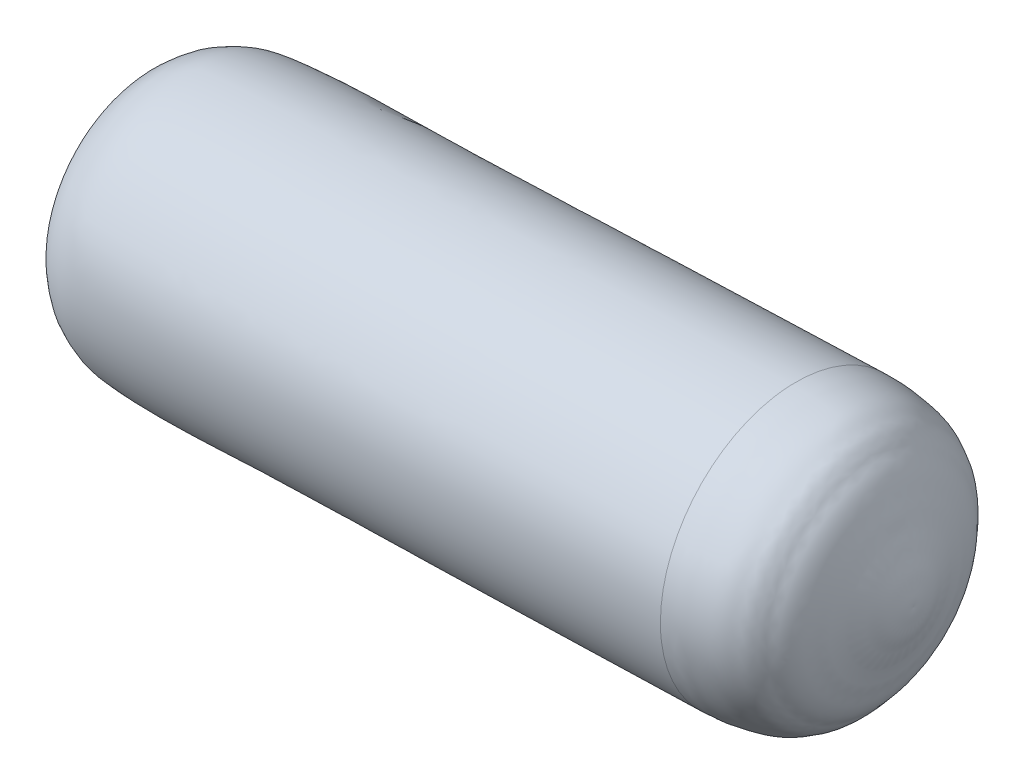
ISO-10303-21;
HEADER;
FILE_DESCRIPTION(('STEP AP214'),'2;1');
FILE_NAME('part.step','',(''),(''),'','','');
FILE_SCHEMA(('AUTOMOTIVE_DESIGN { 1 0 10303 214 1 1 1 1 }'));
ENDSEC;
DATA;
#1=APPLICATION_CONTEXT('core data for automotive mechanical design processes');
#2=APPLICATION_PROTOCOL_DEFINITION('international standard','automotive_design',2000,#1);
#3=PRODUCT_CONTEXT('',#1,'mechanical');
#4=PRODUCT('Part','Part','',(#3));
#5=PRODUCT_RELATED_PRODUCT_CATEGORY('part','',(#4));
#6=PRODUCT_DEFINITION_FORMATION('','',#4);
#7=PRODUCT_DEFINITION_CONTEXT('part definition',#1,'design');
#8=PRODUCT_DEFINITION('design','',#6,#7);
#9=PRODUCT_DEFINITION_SHAPE('','',#8);
#10=(LENGTH_UNIT() NAMED_UNIT(*) SI_UNIT(.MILLI.,.METRE.));
#11=(NAMED_UNIT(*) PLANE_ANGLE_UNIT() SI_UNIT($,.RADIAN.));
#12=(NAMED_UNIT(*) SI_UNIT($,.STERADIAN.) SOLID_ANGLE_UNIT());
#13=UNCERTAINTY_MEASURE_WITH_UNIT(LENGTH_MEASURE(1.E-05),#10,'distance_accuracy_value','');
#14=(GEOMETRIC_REPRESENTATION_CONTEXT(3) GLOBAL_UNCERTAINTY_ASSIGNED_CONTEXT((#13)) GLOBAL_UNIT_ASSIGNED_CONTEXT((#10,
#11,#12)) REPRESENTATION_CONTEXT('',''));
#15=CARTESIAN_POINT('',(0.,0.,0.));
#16=DIRECTION('',(0.,0.,1.));
#17=DIRECTION('',(1.,0.,0.));
#18=AXIS2_PLACEMENT_3D('',#15,#16,#17);
#19=CARTESIAN_POINT('',(-249.997315059477,86.4708925902134,9.03555901143604));
#20=CARTESIAN_POINT('',(-249.392839643392,86.775167829412,9.01524158176353));
#21=CARTESIAN_POINT('',(-244.904101907136,91.7279004312678,8.86436759938493));
#22=CARTESIAN_POINT('',(-242.245314390431,100.33289288089,8.77500130433415));
#23=CARTESIAN_POINT('',(-236.315603753676,111.038696427331,8.57569381285522));
#24=CARTESIAN_POINT('',(-232.331714899698,118.456197486051,8.44178864573028));
#25=CARTESIAN_POINT('',(-228.352755073559,125.567237763208,8.30804915147442));
#26=CARTESIAN_POINT('',(-224.64282545321,130.435672501077,8.18335221236713));
#27=CARTESIAN_POINT('',(-220.074052442527,134.236978606939,8.02978811056231));
#28=CARTESIAN_POINT('',(-215.978095541198,137.619159637047,7.89211614894086));
#29=CARTESIAN_POINT('',(-211.888479210006,139.506144457284,7.75465730448581));
#30=CARTESIAN_POINT('',(-207.937470942682,141.372100634887,7.62185730886851));
#31=CARTESIAN_POINT('',(-203.130942164617,143.183760423172,7.46030183809402));
#32=CARTESIAN_POINT('',(-196.968596145294,144.411431516793,7.25317508234248));
#33=CARTESIAN_POINT('',(-189.390501580477,145.200852321476,6.99846265024809));
#34=CARTESIAN_POINT('',(-178.71220949237,145.920748233469,6.63954739455784));
#35=CARTESIAN_POINT('',(-164.627353889003,146.457866721204,6.1661318419085));
#36=CARTESIAN_POINT('',(-142.443649789491,146.635629208932,5.42050044661258));
#37=CARTESIAN_POINT('',(-99.4522066639701,145.945993745118,3.97548614333521));
#38=CARTESIAN_POINT('',(-39.6649602200606,146.221481857096,1.96593680085844));
#39=CARTESIAN_POINT('',(29.454314195614,146.6489932236,-0.357277608836793));
#40=CARTESIAN_POINT('',(82.9011827569552,146.757531283674,-2.15371624689397));
#41=CARTESIAN_POINT('',(125.725845446338,146.873448404981,-3.59312478078548));
#42=CARTESIAN_POINT('',(148.092466784984,146.821762733771,-4.34490433040349));
#43=CARTESIAN_POINT('',(161.448063122901,147.001699590467,-4.79380825951195));
#44=CARTESIAN_POINT('',(162.912513872113,147.021429796287,-4.84303089837239));
#45=CARTESIAN_POINT('',(164.376964621325,147.041160002107,-4.89225353723284));
#46=B_SPLINE_CURVE_WITH_KNOTS('',3,(#19,#20,#21,#22,#23,#24,#25,#26,#27,#28,#29,#30,#31,#32,#33,
#34,#35,#36,#37,#38,#39,#40,#41,#42,#43,#44,#45),.UNSPECIFIED.,.F.,.F.,(4,1,1,1,1,1,1,1,1,1,1,1,
1,1,1,1,1,1,1,1,1,1,2,4),(0.00579873875436729,0.010719594045195,0.0495341063040441,
0.066049195348457,0.093708236145861,0.106676444318231,0.121341160904225,0.134878114114127,
0.146949418405602,0.157191348444054,0.165282813685045,0.176645251842296,0.191942847620492,
0.207773150546367,0.228359599879056,0.264583110954174,0.303440359648283,0.378941800817676,
0.556452706629631,0.709285089439045,0.848168664545565,0.919272177993649,1.,1.00994201261246),.UNSPECIFIED.);
#47=CARTESIAN_POINT('',(230.558173740901,64.9287620850524,-7.1167146586416));
#48=DIRECTION('',(-0.999435605909356,0.,0.0335927021925529));
#49=AXIS1_PLACEMENT('',#47,#48);
#50=SURFACE_OF_REVOLUTION('',#46,#49);
#51=OFFSET_SURFACE('',#50,-2.54,.F.);
#52=CARTESIAN_POINT('',(-251.028007892334,64.9287620850524,9.0702023213016));
#53=DIRECTION('',(-0.999435605909356,0.,0.0335927021925529));
#54=DIRECTION('',(0.0335927021925529,0.,0.999435605909356));
#55=AXIS2_PLACEMENT_3D('',#52,#53,#54);
#56=CIRCLE('',#55,23.8902883606627);
#57=CARTESIAN_POINT('',(-250.225468550141,64.9287620850524,32.9470071443898));
#58=VERTEX_POINT('',#57);
#59=EDGE_CURVE('E13',#58,#58,#56,.T.);
#60=ORIENTED_EDGE('',*,*,#59,.F.);
#61=EDGE_LOOP('',(#60));
#62=FACE_BOUND('',#61,.T.);
#63=CARTESIAN_POINT('',(162.807135501761,64.9287620850524,79.8014743777546));
#64=CARTESIAN_POINT('',(162.807136488084,66.3129163579225,79.8015037225309));
#65=CARTESIAN_POINT('',(162.805994318118,67.6970681324296,79.7675223734601));
#66=CARTESIAN_POINT('',(162.801430747682,70.4620384748768,79.6317489911236));
#67=CARTESIAN_POINT('',(162.798009347212,71.842857042817,79.5299569578594));
#68=CARTESIAN_POINT('',(162.78889439784,74.5978327624663,79.2587729106236));
#69=CARTESIAN_POINT('',(162.783200848938,75.9719899141748,79.0893808966463));
#70=CARTESIAN_POINT('',(162.769555629937,78.7103327908766,78.6834142184556));
#71=CARTESIAN_POINT('',(162.761603959838,80.0745185158708,78.4468395542481));
#72=CARTESIAN_POINT('',(162.743461571337,82.7896319744682,77.9070750260933));
#73=CARTESIAN_POINT('',(162.733270852935,84.140559708072,77.6038851621489));
#74=CARTESIAN_POINT('',(162.710674940525,86.8259027135277,76.9316213095482));
#75=CARTESIAN_POINT('',(162.698269746517,88.1603179853775,76.5625473208835));
#76=CARTESIAN_POINT('',(162.671274762109,90.8094213349857,75.7594041725231));
#77=CARTESIAN_POINT('',(162.65668497171,92.1241094127464,75.3253350128346));
#78=CARTESIAN_POINT('',(162.62535594419,94.7305911780609,74.393247280662));
#79=CARTESIAN_POINT('',(162.608616707068,96.0223848656126,73.8952287081719));
#80=CARTESIAN_POINT('',(162.573029111987,98.5799658054781,72.8364419080694));
#81=CARTESIAN_POINT('',(162.554180754029,99.8457530577947,72.2756736804636));
#82=CARTESIAN_POINT('',(162.514420324704,102.348271735275,71.0927385132247));
#83=CARTESIAN_POINT('',(162.493508253338,103.585003160435,70.4705715735849));
#84=CARTESIAN_POINT('',(162.449670776178,106.026430788958,69.1663378361334));
#85=CARTESIAN_POINT('',(162.426745370384,107.231126992324,68.484271038328));
#86=CARTESIAN_POINT('',(162.378936453697,109.605581958874,67.0618807433092));
#87=CARTESIAN_POINT('',(162.354052942804,110.775340722053,66.3215572460891));
#88=CARTESIAN_POINT('',(162.302387762544,113.077102756674,64.7844370564493));
#89=CARTESIAN_POINT('',(162.275606093176,114.209106028119,63.9876403640338));
#90=CARTESIAN_POINT('',(162.220209115215,116.432629984336,62.3394933369947));
#91=CARTESIAN_POINT('',(162.191593806621,117.524150669107,61.4881430023708));
#92=CARTESIAN_POINT('',(162.132598487105,119.664079883065,59.7329396684121));
#93=CARTESIAN_POINT('',(162.102218476184,120.712488412251,58.8290866690757));
#94=CARTESIAN_POINT('',(162.03976694007,122.763667607009,56.9710554667773));
#95=CARTESIAN_POINT('',(162.007695414878,123.766438272582,56.0168772638163));
#96=CARTESIAN_POINT('',(161.941938113336,125.723925977766,54.060494353125));
#97=CARTESIAN_POINT('',(161.908252336988,126.678643017377,53.0582896453949));
#98=CARTESIAN_POINT('',(161.839347685157,128.537723473749,51.0082681239967));
#99=CARTESIAN_POINT('',(161.804128809675,129.442086890506,49.9604513103247));
#100=CARTESIAN_POINT('',(161.732242804872,131.198281410286,47.8217298597419));
#101=CARTESIAN_POINT('',(161.695575675551,132.050112513316,46.7308252228366));
#102=CARTESIAN_POINT('',(161.620881497515,133.699190270066,44.5085562104323));
#103=CARTESIAN_POINT('',(161.582854448799,134.496436923784,43.3771918349316));
#104=CARTESIAN_POINT('',(161.505532042251,136.034425144866,41.0767289012366));
#105=CARTESIAN_POINT('',(161.466236684417,136.775166712228,39.9076303430414));
#106=CARTESIAN_POINT('',(161.386472325818,138.198360249203,37.5345155049063));
#107=CARTESIAN_POINT('',(161.346003325053,138.88081221882,36.3304992249695));
#108=CARTESIAN_POINT('',(161.2639891738,140.18578247391,33.8904495237354));
#109=CARTESIAN_POINT('',(161.222444023312,140.808300759373,32.6544161024328));
#110=CARTESIAN_POINT('',(161.138377658656,141.991903944907,30.1533098315303));
#111=CARTESIAN_POINT('',(161.095856444488,142.552988844982,28.8882369819326));
#112=CARTESIAN_POINT('',(161.009940389656,143.612373557068,26.3320995257906));
#113=CARTESIAN_POINT('',(160.966545548992,144.110673369085,25.0410349192492));
#114=CARTESIAN_POINT('',(160.87898678323,145.043287457279,22.4360242366774));
#115=CARTESIAN_POINT('',(160.834822858132,145.47760173345,21.1220781606449));
#116=CARTESIAN_POINT('',(160.745832318279,146.281198448797,18.474469950282));
#117=CARTESIAN_POINT('',(160.701005703525,146.650480887967,17.1408078159499));
#118=CARTESIAN_POINT('',(160.610797775578,147.323124295475,14.4569803981926));
#119=CARTESIAN_POINT('',(160.565416462384,147.626485263823,13.1068151147697));
#120=CARTESIAN_POINT('',(160.474208465023,148.166554906641,10.3932340649116));
#121=CARTESIAN_POINT('',(160.428381780854,148.403263581104,9.02981829847479));
#122=CARTESIAN_POINT('',(160.336393442202,148.809458384158,6.29302087086646));
#123=CARTESIAN_POINT('',(160.290231787718,148.978944512755,4.91963920969585));
#124=CARTESIAN_POINT('',(160.197684715774,149.250285917182,2.16621858918405));
#125=CARTESIAN_POINT('',(160.151299298314,149.35214119301,0.786179629842705));
#126=CARTESIAN_POINT('',(160.05841644707,149.487975513609,-1.97723095221103));
#127=CARTESIAN_POINT('',(160.011919013286,149.521954558383,-3.36060257492333));
#128=CARTESIAN_POINT('',(159.918924145647,149.521954558383,-6.1273458203472));
#129=CARTESIAN_POINT('',(159.872426711791,149.487975513609,-7.51071744305878));
#130=CARTESIAN_POINT('',(159.77954386053,149.35214119301,-10.2741280251106));
#131=CARTESIAN_POINT('',(159.733158443125,149.250285917182,-11.6541669844508));
#132=CARTESIAN_POINT('',(159.640611371206,148.978944512742,-14.4075876051037));
#133=CARTESIAN_POINT('',(159.594449716693,148.809458384123,-15.7809692664159));
#134=CARTESIAN_POINT('',(159.502461378046,148.403263581055,-18.5177666940246));
#135=CARTESIAN_POINT('',(159.456634693914,148.166554906612,-19.8811824603221));
#136=CARTESIAN_POINT('',(159.365426696651,147.626485263822,-22.5947635100437));
#137=CARTESIAN_POINT('',(159.32004538352,147.323124295476,-23.9449287934679));
#138=CARTESIAN_POINT('',(159.229837455495,146.650480887969,-26.6287562112201));
#139=CARTESIAN_POINT('',(159.1850108406,146.281198448798,-27.9624183455457));
#140=CARTESIAN_POINT('',(159.096020300708,145.477601733444,-30.6100265559323));
#141=CARTESIAN_POINT('',(159.05185637571,145.043287457265,-31.9239726319945));
#142=CARTESIAN_POINT('',(158.964297610033,144.110673369024,-34.5289833146933));
#143=CARTESIAN_POINT('',(158.920902769354,143.612373556964,-35.820047921331));
#144=CARTESIAN_POINT('',(158.834986714489,142.552988844826,-38.3761853775653));
#145=CARTESIAN_POINT('',(158.792465500303,141.991903944745,-39.6412582271612));
#146=CARTESIAN_POINT('',(158.708399135633,140.808300759301,-42.1423644978428));
#147=CARTESIAN_POINT('',(158.666853985148,140.185782473944,-43.3783979189314));
#148=CARTESIAN_POINT('',(158.584839833872,138.880812218875,-45.8184476201458));
#149=CARTESIAN_POINT('',(158.544370833081,138.198360249154,-47.0224639002666));
#150=CARTESIAN_POINT('',(158.464606474498,136.775166712115,-49.395578738488));
#151=CARTESIAN_POINT('',(158.425311116707,136.034425144806,-50.5646772965936));
#152=CARTESIAN_POINT('',(158.347988710165,134.496436923731,-52.8651402302792));
#153=CARTESIAN_POINT('',(158.309961661416,133.699190269958,-53.9965046058546));
#154=CARTESIAN_POINT('',(158.235267483367,132.050112513201,-56.2187736182546));
#155=CARTESIAN_POINT('',(158.198600354067,131.198281410225,-57.3096782550863));
#156=CARTESIAN_POINT('',(158.126714349253,129.442086890533,-59.4483997055606));
#157=CARTESIAN_POINT('',(158.09149547374,128.537723473808,-60.4962165191963));
#158=CARTESIAN_POINT('',(158.022590821918,126.678643017443,-62.5462380405949));
#159=CARTESIAN_POINT('',(157.988905045609,125.723925977803,-63.5484427483587));
#160=CARTESIAN_POINT('',(157.923147744099,123.766438272547,-65.5048256591234));
#161=CARTESIAN_POINT('',(157.891076218898,122.76366760693,-66.4590038621235));
#162=CARTESIAN_POINT('',(157.828624682764,120.712488412166,-68.3170350644188));
#163=CARTESIAN_POINT('',(157.798244671831,119.664079883022,-69.2208880637172));
#164=CARTESIAN_POINT('',(157.739249352352,117.52415066906,-70.9760913976806));
#165=CARTESIAN_POINT('',(157.710634043806,116.432629984241,-71.8274417323426));
#166=CARTESIAN_POINT('',(157.655237065845,114.209106028022,-73.4755887593741));
#167=CARTESIAN_POINT('',(157.628455396431,113.077102756627,-74.2723854517485));
#168=CARTESIAN_POINT('',(157.576790216148,110.775340722108,-75.8095056413282));
#169=CARTESIAN_POINT('',(157.551906705279,109.605581958982,-76.549829138529));
#170=CARTESIAN_POINT('',(157.504097788619,107.23112699243,-77.9722194335253));
#171=CARTESIAN_POINT('',(157.481172382826,106.026430789007,-78.6542862313223));
#172=CARTESIAN_POINT('',(157.437334905661,103.585003160434,-79.9585199689143));
#173=CARTESIAN_POINT('',(157.416422834287,102.348271735284,-80.5806869087059));
#174=CARTESIAN_POINT('',(157.376662404981,99.8457530576655,-81.7636220755833));
#175=CARTESIAN_POINT('',(157.357814047047,98.5799658051984,-82.3243903026697));
#176=CARTESIAN_POINT('',(157.322226451905,96.0223848654065,-83.3831771043187));
#177=CARTESIAN_POINT('',(157.305487214697,94.7305911780839,-83.8811956788868));
#178=CARTESIAN_POINT('',(157.27415818735,92.1241094125238,-84.8132834052242));
#179=CARTESIAN_POINT('',(157.259568397212,90.8094213342847,-85.2473525569888));
#180=CARTESIAN_POINT('',(157.232573412085,88.1603179857565,-86.0504957270577));
#181=CARTESIAN_POINT('',(157.220168217096,86.8259027154682,-86.4195697453639));
#182=CARTESIAN_POINT('',(157.197572307421,84.1405597060471,-87.0918335168986));
#183=CARTESIAN_POINT('',(157.187381592736,82.7896319669141,-87.3950232701262));
#184=CARTESIAN_POINT('',(157.169239194064,80.0745185230996,-87.934788100823));
#185=CARTESIAN_POINT('',(157.161287510077,78.7103328184183,-88.1713631782936));
#186=CARTESIAN_POINT('',(157.147642329025,75.9719898862942,-88.5773287274029));
#187=CARTESIAN_POINT('',(157.14194883196,74.5978326588512,-88.7467191990398));
#188=CARTESIAN_POINT('',(157.132833740972,71.8428571463244,-89.0179074599972));
#189=CARTESIAN_POINT('',(157.129412147049,70.4620388612405,-89.1197052493158));
#190=CARTESIAN_POINT('',(157.124849105179,67.6970677457883,-89.2554629058276));
#191=CARTESIAN_POINT('',(157.123707657232,66.3129149154204,-89.2894227730269));
#192=CARTESIAN_POINT('',(157.123707657231,63.5446092546131,-89.2894227730269));
#193=CARTESIAN_POINT('',(157.124849105178,62.1604564241737,-89.2554629058241));
#194=CARTESIAN_POINT('',(157.129412147051,59.3954853087289,-89.1197052493057));
#195=CARTESIAN_POINT('',(157.132833740977,58.0146670237234,-89.0179074599915));
#196=CARTESIAN_POINT('',(157.141948831959,55.2596915113039,-88.746719199045));
#197=CARTESIAN_POINT('',(157.147642329014,53.88553428389,-88.5773287274124));
#198=CARTESIAN_POINT('',(157.161287510087,51.1471913517521,-88.1713631783056));
#199=CARTESIAN_POINT('',(157.169239194106,49.7830056470284,-87.9347881008299));
#200=CARTESIAN_POINT('',(157.187381592774,47.0678922030757,-87.3950232701047));
#201=CARTESIAN_POINT('',(157.197572307423,45.7169644638475,-87.0918335168513));
#202=CARTESIAN_POINT('',(157.220168217097,43.0316214544327,-86.4195697453075));
#203=CARTESIAN_POINT('',(157.23257341212,41.6972061842433,-86.0504957270276));
#204=CARTESIAN_POINT('',(157.259568397265,39.0481028357777,-85.2473525569784));
#205=CARTESIAN_POINT('',(157.274158187387,37.7334147575042,-84.8132834052004));
#206=CARTESIAN_POINT('',(157.305487214689,35.1269329918766,-83.8811956788327));
#207=CARTESIAN_POINT('',(157.322226451868,33.835139304521,-83.3831771042475));
#208=CARTESIAN_POINT('',(157.357814047,31.2775583647384,-82.3243903025937));
#209=CARTESIAN_POINT('',(157.376662404951,30.0117711123122,-81.7636220755235));
#210=CARTESIAN_POINT('',(157.416422834286,27.5092524347744,-80.5806869086819));
#211=CARTESIAN_POINT('',(157.437334905668,26.272521009663,-79.95851996891));
#212=CARTESIAN_POINT('',(157.481172382818,23.8310933811348,-78.6542862313421));
#213=CARTESIAN_POINT('',(157.504097788585,22.626397177717,-77.9722194335479));
#214=CARTESIAN_POINT('',(157.551906705244,20.2519422111367,-76.5498291385364));
#215=CARTESIAN_POINT('',(157.576790216136,19.0821834479765,-75.8095056413155));
#216=CARTESIAN_POINT('',(157.628455396444,16.7804214134106,-74.2723854517033));
#217=CARTESIAN_POINT('',(157.655237065858,15.6484181420015,-73.475588759317));
#218=CARTESIAN_POINT('',(157.710634043813,13.4248941857815,-71.8274417322792));
#219=CARTESIAN_POINT('',(157.739249352353,12.3333735009733,-70.9760913976237));
#220=CARTESIAN_POINT('',(157.798244671836,10.1934442869734,-69.2208880636258));
#221=CARTESIAN_POINT('',(157.828624682779,9.14503575778173,-68.3170350642833));
#222=CARTESIAN_POINT('',(157.891076218917,7.09385656307995,-66.4590038620328));
#223=CARTESIAN_POINT('',(157.923147744112,6.091085897566,-65.504825659129));
#224=CARTESIAN_POINT('',(157.988905045626,4.13359819239508,-63.5484427484565));
#225=CARTESIAN_POINT('',(158.022590821947,3.17888115274277,-62.5462380406831));
#226=CARTESIAN_POINT('',(158.09149547376,1.31980069639895,-60.4962165193131));
#227=CARTESIAN_POINT('',(158.126714349254,0.415437279705917,-59.4483997057179));
#228=CARTESIAN_POINT('',(158.198600354059,-1.34075724007635,-57.3096782551463));
#229=CARTESIAN_POINT('',(158.235267483372,-2.192588343165,-56.2187736181694));
#230=CARTESIAN_POINT('',(158.309961661443,-3.8416660999544,-53.9965046057116));
#231=CARTESIAN_POINT('',(158.347988710203,-4.63891275365737,-52.8651402302323));
#232=CARTESIAN_POINT('',(158.425311116739,-6.17690097472454,-50.564677296562));
#233=CARTESIAN_POINT('',(158.464606474515,-6.91764254208657,-49.3955787383695));
#234=CARTESIAN_POINT('',(158.544370833094,-8.3408360791353,-47.0224639001159));
#235=CARTESIAN_POINT('',(158.584839833895,-9.0232880488208,-45.8184476200539));
#236=CARTESIAN_POINT('',(158.666853985132,-10.328258303896,-43.3783979188221));
#237=CARTESIAN_POINT('',(158.708399135566,-10.9507765892887,-42.1423644976538));
#238=CARTESIAN_POINT('',(158.792465500221,-12.1343797747145,-39.6412582269867));
#239=CARTESIAN_POINT('',(158.834986714442,-12.6954646747504,-38.3761853774893));
#240=CARTESIAN_POINT('',(158.920902769316,-13.7548493868725,-35.8200479212973));
#241=CARTESIAN_POINT('',(158.964297609969,-14.253149198953,-34.5289833146004));
#242=CARTESIAN_POINT('',(159.051856375695,-15.1857632872154,-31.9239726318304));
#243=CARTESIAN_POINT('',(159.096020300768,-15.6200775633969,-30.6100265557571));
#244=CARTESIAN_POINT('',(159.185010840613,-16.4236742787162,-27.9624183454592));
#245=CARTESIAN_POINT('',(159.229837455384,-16.7929567178556,-26.628756211235));
#246=CARTESIAN_POINT('',(159.320045383386,-17.4656001253507,-23.9449287935465));
#247=CARTESIAN_POINT('',(159.365426696616,-17.7689610937087,-22.5947635100827));
#248=CARTESIAN_POINT('',(159.456634693948,-18.3090307365149,-19.8811824602848));
#249=CARTESIAN_POINT('',(159.502461378048,-18.5457394109625,-18.5177666939506));
#250=CARTESIAN_POINT('',(159.594449716688,-18.9519342140168,-15.7809692664149));
#251=CARTESIAN_POINT('',(159.640611371226,-19.1214203426229,-14.4075876052133));
#252=CARTESIAN_POINT('',(159.733158443172,-19.3927617470637,-11.6541669846352));
#253=CARTESIAN_POINT('',(159.779543860579,-19.4946170228968,-10.2741280252585));
#254=CARTESIAN_POINT('',(159.872426711814,-19.6304513435032,-7.51071744313234));
#255=CARTESIAN_POINT('',(159.918924145642,-19.6644303882782,-6.12734582038297));
#256=CARTESIAN_POINT('',(160.011919013291,-19.6644303882783,-3.36060257488561));
#257=CARTESIAN_POINT('',(160.058416447111,-19.6304513435033,-1.97723095213763));
#258=CARTESIAN_POINT('',(160.151299298359,-19.4946170229002,0.786179629915895));
#259=CARTESIAN_POINT('',(160.197684715786,-19.3927617470738,2.16621858922152));
#260=CARTESIAN_POINT('',(160.290231787712,-19.1214203426465,4.91963920973385));
#261=CARTESIAN_POINT('',(160.33639344221,-18.9519342140437,6.29302087094037));
#262=CARTESIAN_POINT('',(160.428381780854,-18.5457394109861,9.02981829854742));
#263=CARTESIAN_POINT('',(160.474208465,-18.3090307365288,10.3932340649476));
#264=CARTESIAN_POINT('',(160.56541646234,-17.7689610936956,13.1068151148805));
#265=CARTESIAN_POINT('',(160.610797775534,-17.4656001253203,14.4569803984134));
#266=CARTESIAN_POINT('',(160.701005703514,-16.7929567178176,17.1408078161035));
#267=CARTESIAN_POINT('',(160.745832318301,-16.4236742786945,18.4744699502618));
#268=CARTESIAN_POINT('',(160.83482285819,-15.6200775634116,21.1220781604375));
#269=CARTESIAN_POINT('',(160.878986783293,-15.1857632872498,22.4360242364544));
#270=CARTESIAN_POINT('',(160.966545549008,-14.253149199015,25.0410349191639));
#271=CARTESIAN_POINT('',(161.009940389619,-13.75484938694,26.3320995258557));
#272=CARTESIAN_POINT('',(161.095856444459,-12.6954646748033,28.8882369821015));
#273=CARTESIAN_POINT('',(161.138377658687,-12.134379774744,30.1533098316565));
#274=CARTESIAN_POINT('',(161.222444023357,-10.9507765892649,32.6544161024363));
#275=CARTESIAN_POINT('',(161.263989173799,-10.3282583038421,33.8904495236598));
#276=CARTESIAN_POINT('',(161.34600332505,-9.02328804874034,36.3304992249278));
#277=CARTESIAN_POINT('',(161.386472325861,-8.34083607906178,37.5345155049726));
#278=CARTESIAN_POINT('',(161.466236684431,-6.91764254201017,39.9076303432237));
#279=CARTESIAN_POINT('',(161.50553204219,-6.17690097463683,41.0767289014299));
#280=CARTESIAN_POINT('',(161.582854448736,-4.63891275362001,43.3771918350137));
#281=CARTESIAN_POINT('',(161.620881497523,-3.84166609998414,44.5085562103964));
#282=CARTESIAN_POINT('',(161.695575675606,-2.19258834322057,46.7308252228282));
#283=CARTESIAN_POINT('',(161.732242804902,-1.34075724008285,47.8217298598699));
#284=CARTESIAN_POINT('',(161.804128809692,0.415437279737889,49.9604513104852));
#285=CARTESIAN_POINT('',(161.839347685186,1.31980069641639,51.0082681240625));
#286=CARTESIAN_POINT('',(161.90825233702,3.17888115273043,53.0582896453984));
#287=CARTESIAN_POINT('',(161.941938113359,4.13359819236753,54.0604943531556));
#288=CARTESIAN_POINT('',(162.007695414884,6.09108589757225,56.0168772638642));
#289=CARTESIAN_POINT('',(162.03976694007,7.09385656313844,56.9710554668169));
#290=CARTESIAN_POINT('',(162.102218476184,9.14503575785613,58.8290866690763));
#291=CARTESIAN_POINT('',(162.132598487112,10.1934442870074,59.7329396683833));
#292=CARTESIAN_POINT('',(162.191593806612,12.3333735009381,61.4881430023236));
#293=CARTESIAN_POINT('',(162.220209115185,13.4248941857182,62.3394933369563));
#294=CARTESIAN_POINT('',(162.275606093156,15.6484181419407,63.9876403640018));
#295=CARTESIAN_POINT('',(162.302387762555,16.7804214133824,64.7844370564156));
#296=CARTESIAN_POINT('',(162.354052942833,19.0821834479305,66.3215572460086));
#297=CARTESIAN_POINT('',(162.378936453712,20.2519422110375,67.0618807431869));
#298=CARTESIAN_POINT('',(162.426745370361,22.6263971776099,68.484271038232));
#299=CARTESIAN_POINT('',(162.449670776131,23.8310933810764,69.1663378360971));
#300=CARTESIAN_POINT('',(162.493508253295,26.2725210096636,70.4705715735815));
#301=CARTESIAN_POINT('',(162.514420324691,27.509252434784,71.0927385132014));
#302=CARTESIAN_POINT('',(162.554180754025,30.011771112303,72.2756736804621));
#303=CARTESIAN_POINT('',(162.573029111964,31.2775583647011,72.8364419081037));
#304=CARTESIAN_POINT('',(162.608616707035,33.8351393045735,73.8952287082032));
#305=CARTESIAN_POINT('',(162.625355944168,35.1269329920473,74.3932472806622));
#306=CARTESIAN_POINT('',(162.656684971719,37.7334147573892,75.3253350128468));
#307=CARTESIAN_POINT('',(162.671274762139,39.0481028352585,75.7594041725693));
#308=CARTESIAN_POINT('',(162.698269746543,41.6972061848447,76.5625473209141));
#309=CARTESIAN_POINT('',(162.710674940528,43.0316214565602,76.9316213095412));
#310=CARTESIAN_POINT('',(162.733270852922,45.7169644619923,77.6038851621417));
#311=CARTESIAN_POINT('',(162.743461571332,47.0678921957099,77.9070750261111));
#312=CARTESIAN_POINT('',(162.761603959844,49.7830056543959,78.4468395542769));
#313=CARTESIAN_POINT('',(162.769555629946,51.1471913793634,78.6834142184773));
#314=CARTESIAN_POINT('',(162.783200848924,53.8855342560001,79.0893808966551));
#315=CARTESIAN_POINT('',(162.788894397801,55.2596914076701,79.2587729106274));
#316=CARTESIAN_POINT('',(162.798009347171,58.0146671273175,79.5299569578632));
#317=CARTESIAN_POINT('',(162.801430747665,59.3954856952947,79.6317489911289));
#318=CARTESIAN_POINT('',(162.805994318135,62.1604560377445,79.7675223734614));
#319=CARTESIAN_POINT('',(162.807136488111,63.544607812217,79.8015037225303));
#320=CARTESIAN_POINT('',(162.807135501761,64.9287620850524,79.8014743777546));
#321=B_SPLINE_CURVE_WITH_KNOTS('',3,(#63,#64,#65,#66,#67,#68,#69,#70,#71,#72,#73,#74,#75,#76,
#77,#78,#79,#80,#81,#82,#83,#84,#85,#86,#87,#88,#89,#90,#91,#92,#93,#94,#95,#96,#97,#98,#99,
#100,#101,#102,#103,#104,#105,#106,#107,#108,#109,#110,#111,#112,#113,#114,#115,#116,#117,#118,
#119,#120,#121,#122,#123,#124,#125,#126,#127,#128,#129,#130,#131,#132,#133,#134,#135,#136,#137,
#138,#139,#140,#141,#142,#143,#144,#145,#146,#147,#148,#149,#150,#151,#152,#153,#154,#155,#156,
#157,#158,#159,#160,#161,#162,#163,#164,#165,#166,#167,#168,#169,#170,#171,#172,#173,#174,#175,
#176,#177,#178,#179,#180,#181,#182,#183,#184,#185,#186,#187,#188,#189,#190,#191,#192,#193,#194,
#195,#196,#197,#198,#199,#200,#201,#202,#203,#204,#205,#206,#207,#208,#209,#210,#211,#212,#213,
#214,#215,#216,#217,#218,#219,#220,#221,#222,#223,#224,#225,#226,#227,#228,#229,#230,#231,#232,
#233,#234,#235,#236,#237,#238,#239,#240,#241,#242,#243,#244,#245,#246,#247,#248,#249,#250,#251,
#252,#253,#254,#255,#256,#257,#258,#259,#260,#261,#262,#263,#264,#265,#266,#267,#268,#269,#270,
#271,#272,#273,#274,#275,#276,#277,#278,#279,#280,#281,#282,#283,#284,#285,#286,#287,#288,#289,
#290,#291,#292,#293,#294,#295,#296,#297,#298,#299,#300,#301,#302,#303,#304,#305,#306,#307,#308,
#309,#310,#311,#312,#313,#314,#315,#316,#317,#318,#319,#320),.UNSPECIFIED.,.F.,.F.,(4,2,2,2,2,2,
2,2,2,2,2,2,2,2,2,2,2,2,2,2,2,2,2,2,2,2,2,2,2,2,2,2,2,2,2,2,2,2,2,2,2,2,2,2,2,2,2,2,2,2,2,2,2,2,
2,2,2,2,2,2,2,2,2,2,2,2,2,2,2,2,2,2,2,2,2,2,2,2,2,2,2,2,2,2,2,2,2,2,2,2,2,2,2,2,2,2,2,2,2,2,2,2,
2,2,2,2,2,2,2,2,2,2,2,2,2,2,2,2,2,2,2,2,2,2,2,2,2,2,4),(0.,4.15204173595904,8.30408347182912,
12.4561252080532,16.6081669439213,20.7602086796058,24.912250415813,29.0642921515587,
33.2163338876897,37.3683756233778,41.5204173595125,45.6724590952076,49.8245008313854,
53.9765425672566,58.1285843031473,62.2806260391545,66.4326677750824,70.5847095109874,
74.7367512472434,78.8887929829706,83.0408347188786,87.1928764548834,91.3449181905312,
95.4969599268631,99.6490016628638,103.80104339841,107.953085134358,112.105126870667,
116.257168606374,120.409210342569,124.561252078392,128.713293814317,132.865335550125,
137.017377285938,141.169419021855,145.321460758109,149.47350249388,153.625544229583,
157.777585965887,161.929627701918,166.08166943778,170.233711173784,174.3857529094,
178.537794645683,182.689836381373,186.841878117561,190.993919853012,195.145961589126,
199.298003325161,203.450045061264,207.602086797104,211.754128533176,215.906170268861,
220.058212004858,224.210253740745,228.362295476873,232.514337212959,236.666378948686,
240.818420684706,244.970462420592,249.12250415654,253.27454589241,257.426587628397,
261.578629364507,265.730671100252,269.88271283621,274.034754572085,278.186796307985,
282.338838043983,286.490879780225,290.642921515805,294.794963251935,298.947004987772,
303.099046723727,307.251088459724,311.403130195591,315.555171931706,319.707213667446,
323.859255403477,328.011297139512,332.163338875192,336.315380611275,340.467422347233,
344.619464083236,348.77150581907,352.923547555062,357.07558929114,361.227631027013,
365.379672762696,369.531714498745,373.683756234816,377.835797970791,381.987839706627,
386.139881442506,390.291923178429,394.443964914456,398.596006650379,402.748048386298,
406.900090122113,411.052131858046,415.204173594128,419.356215330174,423.508257065947,
427.660298801842,431.812340537867,435.964382273737,440.116424009798,444.268465745822,
448.420507481866,452.572549217349,456.724590953595,460.876632689484,465.028674425501,
469.180716161396,473.332757897268,477.484799633195,481.636841369056,485.788883104984,
489.940924841027,494.09296657703,498.245008312984,502.397050048864,506.549091784951,
510.70113352074,514.853175256774,519.00521699256,523.157258728667,527.309300464648,
531.461342200504),.UNSPECIFIED.);
#322=CARTESIAN_POINT('',(162.807135501761,64.9287620850524,79.8014743777546));
#323=VERTEX_POINT('',#322);
#324=EDGE_CURVE('E55',#323,#323,#321,.T.);
#325=ORIENTED_EDGE('',*,*,#324,.T.);
#326=EDGE_LOOP('',(#325));
#327=FACE_BOUND('',#326,.T.);
#328=ADVANCED_FACE('F43',(#62,#327),#51,.F.);
#329=CARTESIAN_POINT('',(159.96762260839,146.981955513107,-4.74404817789817));
#330=CARTESIAN_POINT('',(159.972952530156,146.981960136953,-4.74422732548262));
#331=CARTESIAN_POINT('',(159.978282451923,146.9819647608,-4.74440647306706));
#332=CARTESIAN_POINT('',(161.955944759633,146.983680434589,-4.81087901071485));
#333=CARTESIAN_POINT('',(165.44324611687,146.678913229245,-4.92809304157055));
#334=CARTESIAN_POINT('',(170.355913315467,146.780605410963,-5.09321600216734));
#335=CARTESIAN_POINT('',(174.875161351828,145.961174765165,-5.24511548675856));
#336=CARTESIAN_POINT('',(179.969784682917,145.281527550832,-5.41635429727582));
#337=CARTESIAN_POINT('',(185.340094001446,144.361923345805,-5.59685937489418));
#338=CARTESIAN_POINT('',(190.221910454036,143.15984569272,-5.76094539032221));
#339=CARTESIAN_POINT('',(194.069433829861,141.316020973899,-5.89026708566585));
#340=CARTESIAN_POINT('',(197.318041783104,139.290360587229,-5.99945823201724));
#341=CARTESIAN_POINT('',(200.772270200738,137.481021764171,-6.11556062606099));
#342=CARTESIAN_POINT('',(203.089920018498,135.029858195521,-6.19346071252407));
#343=CARTESIAN_POINT('',(205.091583050728,132.988580092182,-6.26073995466232));
#344=CARTESIAN_POINT('',(206.960496159433,130.282064866227,-6.32355724985698));
#345=CARTESIAN_POINT('',(209.970284236666,127.412937472529,-6.42472126076813));
#346=CARTESIAN_POINT('',(212.864960611418,123.098725266639,-6.52201617484355));
#347=CARTESIAN_POINT('',(215.345041093261,118.010701594132,-6.60537582757907));
#348=CARTESIAN_POINT('',(217.274907084841,112.214704172206,-6.67024185110611));
#349=CARTESIAN_POINT('',(220.181520586087,106.051453073416,-6.7679379919669));
#350=CARTESIAN_POINT('',(221.169615819919,99.6563210434216,-6.80114952528803));
#351=CARTESIAN_POINT('',(223.747304403476,94.5967959371702,-6.8877899495641));
#352=CARTESIAN_POINT('',(225.025105110275,90.0082295199418,-6.93073896834141));
#353=CARTESIAN_POINT('',(226.721742665159,85.477001035342,-6.98776579405479));
#354=CARTESIAN_POINT('',(229.041418010259,80.1808181741387,-7.0657339618793));
#355=CARTESIAN_POINT('',(230.008283550027,73.2505057620045,-7.09823192967797));
#356=CARTESIAN_POINT('',(231.057674274491,68.1138868261967,-7.13350370695116));
#357=CARTESIAN_POINT('',(230.67647606347,65.2659211069931,-7.12069099755452));
#358=B_SPLINE_CURVE_WITH_KNOTS('',3,(#329,#330,#331,#332,#333,#334,#335,#336,#337,#338,#339,
#340,#341,#342,#343,#344,#345,#346,#347,#348,#349,#350,#351,#352,#353,#354,#355,#356,#357),
.UNSPECIFIED.,.F.,.F.,(4,2,1,1,1,1,1,1,1,1,1,1,1,1,1,1,1,1,1,1,1,1,1,1,1,4),
(-0.000130425654726145,0.,0.0482638871725288,0.0857552608747859,0.119936024380544,
0.160447766645281,0.211727518471583,0.253463805081338,0.283025426383357,0.315723956167872,
0.347447633390503,0.377649860184101,0.397607921983478,0.417452752235979,0.457888953807314,
0.498880002250011,0.543929691440956,0.59611952777683,0.648347014969616,0.709998565719199,
0.7524058785054,0.786364044638253,0.826358130772534,0.870980447705509,0.927053031309992,
0.997230378065162),.UNSPECIFIED.);
#359=CARTESIAN_POINT('',(230.558173740901,64.9287620850524,-7.1167146586416));
#360=DIRECTION('',(-0.999435605909356,0.,0.0335927021925529));
#361=AXIS1_PLACEMENT('',#359,#360);
#362=SURFACE_OF_REVOLUTION('',#358,#361);
#363=OFFSET_SURFACE('',#362,-2.54,.F.);
#364=CARTESIAN_POINT('',(233.192578533429,64.9287620850524,-7.2052614095546));
#365=VERTEX_POINT('',#364);
#366=VERTEX_LOOP('',#365);
#367=FACE_BOUND('',#366,.T.);
#368=ORIENTED_EDGE('',*,*,#324,.F.);
#369=EDGE_LOOP('',(#368));
#370=FACE_BOUND('',#369,.T.);
#371=ADVANCED_FACE('F94',(#367,#370),#363,.F.);
#372=CARTESIAN_POINT('',(-254.201863799916,87.8641279786183,9.17688092638136));
#373=CARTESIAN_POINT('',(-253.68729530374,87.5215060140963,9.15958541864931));
#374=CARTESIAN_POINT('',(-253.172726807565,87.1788840495743,9.14228991091727));
#375=CARTESIAN_POINT('',(-252.225035101243,86.5478699152171,9.11043640772746));
#376=CARTESIAN_POINT('',(-251.830454370317,86.3743536389211,9.09717388945562));
#377=CARTESIAN_POINT('',(-251.467685741132,86.2919584475543,9.08498062912653));
#378=B_SPLINE_CURVE_WITH_KNOTS('',3,(#372,#373,#374,#375,#376,#377),.UNSPECIFIED.,.F.,.F.,(4,2,
4),(-0.00271716849276282,0.,0.00228709831411034),.UNSPECIFIED.);
#379=CARTESIAN_POINT('',(230.558173740901,64.9287620850524,-7.1167146586416));
#380=DIRECTION('',(-0.999435605909356,0.,0.0335927021925529));
#381=AXIS1_PLACEMENT('',#379,#380);
#382=SURFACE_OF_REVOLUTION('',#378,#381);
#383=OFFSET_SURFACE('',#382,-2.54,.F.);
#384=ORIENTED_EDGE('',*,*,#59,.T.);
#385=EDGE_LOOP('',(#384));
#386=FACE_BOUND('',#385,.T.);
#387=CARTESIAN_POINT('',(-252.795475555904,64.9287620850524,9.12960986542572));
#388=DIRECTION('',(-0.999435605909356,0.,0.0335927021925529));
#389=DIRECTION('',(0.0335927021925529,0.,0.999435605909356));
#390=AXIS2_PLACEMENT_3D('',#387,#388,#389);
#391=CIRCLE('',#390,25.0499432872554);
#392=CARTESIAN_POINT('',(-251.953980271115,64.9287620850524,34.1654151127189));
#393=VERTEX_POINT('',#392);
#394=EDGE_CURVE('E72',#393,#393,#391,.T.);
#395=ORIENTED_EDGE('',*,*,#394,.F.);
#396=EDGE_LOOP('',(#395));
#397=FACE_BOUND('',#396,.T.);
#398=ADVANCED_FACE('F97',(#386,#397),#383,.F.);
#399=CARTESIAN_POINT('',(-251.700853036732,64.9287620850524,9.09281777188573));
#400=DIRECTION('',(-0.999435605909356,0.,0.0335927021925529));
#401=DIRECTION('',(0.0335927021925529,0.,0.999435605909356));
#402=AXIS2_PLACEMENT_3D('',#399,#400,#401);
#403=CONICAL_SURFACE('',#402,0.,1.52710187398964);
#404=CARTESIAN_POINT('',(-252.65815831139,64.9287620850524,9.12499440318523));
#405=DIRECTION('',(-0.999435605909356,0.,0.0335927021925529));
#406=DIRECTION('',(0.0335927021925529,0.,0.999435605909356));
#407=AXIS2_PLACEMENT_3D('',#404,#405,#406);
#408=CIRCLE('',#407,21.9074999999998);
#409=CARTESIAN_POINT('',(-251.922226188107,64.9287620850524,31.0201299396443));
#410=VERTEX_POINT('',#409);
#411=EDGE_CURVE('E73',#410,#410,#408,.T.);
#412=ORIENTED_EDGE('',*,*,#411,.F.);
#413=EDGE_LOOP('',(#412));
#414=FACE_BOUND('',#413,.T.);
#415=ORIENTED_EDGE('',*,*,#394,.T.);
#416=EDGE_LOOP('',(#415));
#417=FACE_BOUND('',#416,.T.);
#418=ADVANCED_FACE('F66',(#414,#417),#403,.F.);
#419=CARTESIAN_POINT('',(159.983612373689,146.981969384646,-4.74458562065151));
#420=CARTESIAN_POINT('',(161.955944759633,146.983680434589,-4.81087901071485));
#421=CARTESIAN_POINT('',(165.44324611687,146.678913229245,-4.92809304157055));
#422=CARTESIAN_POINT('',(170.355913315467,146.780605410963,-5.09321600216734));
#423=CARTESIAN_POINT('',(174.875161351828,145.961174765165,-5.24511548675856));
#424=CARTESIAN_POINT('',(179.969784682917,145.281527550832,-5.41635429727582));
#425=CARTESIAN_POINT('',(185.340094001446,144.361923345805,-5.59685937489418));
#426=CARTESIAN_POINT('',(190.221910454036,143.15984569272,-5.76094539032221));
#427=CARTESIAN_POINT('',(194.069433829861,141.316020973899,-5.89026708566585));
#428=CARTESIAN_POINT('',(197.318041783104,139.290360587229,-5.99945823201724));
#429=CARTESIAN_POINT('',(200.772270200738,137.481021764171,-6.11556062606099));
#430=CARTESIAN_POINT('',(203.089920018498,135.029858195521,-6.19346071252407));
#431=CARTESIAN_POINT('',(205.091583050728,132.988580092182,-6.26073995466232));
#432=CARTESIAN_POINT('',(206.960496159433,130.282064866227,-6.32355724985698));
#433=CARTESIAN_POINT('',(209.970284236666,127.412937472529,-6.42472126076813));
#434=CARTESIAN_POINT('',(212.864960611418,123.098725266639,-6.52201617484355));
#435=CARTESIAN_POINT('',(215.345041093261,118.010701594132,-6.60537582757907));
#436=CARTESIAN_POINT('',(217.274907084841,112.214704172206,-6.67024185110611));
#437=CARTESIAN_POINT('',(220.181520586087,106.051453073416,-6.7679379919669));
#438=CARTESIAN_POINT('',(221.169615819919,99.6563210434216,-6.80114952528803));
#439=CARTESIAN_POINT('',(223.747304403476,94.5967959371702,-6.8877899495641));
#440=CARTESIAN_POINT('',(225.025105110275,90.0082295199418,-6.93073896834141));
#441=CARTESIAN_POINT('',(226.721742665159,85.477001035342,-6.98776579405479));
#442=CARTESIAN_POINT('',(229.041418010259,80.1808181741387,-7.0657339618793));
#443=CARTESIAN_POINT('',(230.023955211455,73.1381742068453,-7.09875868042818));
#444=CARTESIAN_POINT('',(231.10387775642,67.8885087670012,-7.13505668325052));
#445=CARTESIAN_POINT('',(230.626770375123,64.9287620850523,-7.11902030624031));
#446=B_SPLINE_CURVE_WITH_KNOTS('',3,(#419,#420,#421,#422,#423,#424,#425,#426,#427,#428,#429,
#430,#431,#432,#433,#434,#435,#436,#437,#438,#439,#440,#441,#442,#443,#444,#445),.UNSPECIFIED.,
.F.,.F.,(4,1,1,1,1,1,1,1,1,1,1,1,1,1,1,1,1,1,1,1,1,1,1,1,4),(0.,0.0482638871725288,
0.0857552608747859,0.119936024380544,0.160447766645281,0.211727518471583,0.253463805081338,
0.283025426383357,0.315723956167872,0.347447633390503,0.377649860184101,0.397607921983478,
0.417452752235979,0.457888953807314,0.498880002250011,0.543929691440956,0.59611952777683,
0.648347014969616,0.709998565719199,0.7524058785054,0.786364044638253,0.826358130772534,
0.870980447705509,0.927053031309992,1.),.UNSPECIFIED.);
#447=CARTESIAN_POINT('',(230.558173740901,64.9287620850524,-7.1167146586416));
#448=DIRECTION('',(-0.999435605909356,0.,0.0335927021925529));
#449=AXIS1_PLACEMENT('',#447,#448);
#450=SURFACE_OF_REVOLUTION('',#446,#449);
#451=CARTESIAN_POINT('',(230.626770375123,64.9287620850523,-7.11902030624031));
#452=VERTEX_POINT('',#451);
#453=VERTEX_LOOP('',#452);
#454=FACE_BOUND('',#453,.T.);
#455=CARTESIAN_POINT('',(159.983612373689,64.9287620850524,-4.74458562065151));
#456=DIRECTION('',(-0.999435605909356,0.,0.0335927021925529));
#457=DIRECTION('',(0.0335927021925529,0.,0.999435605909356));
#458=AXIS2_PLACEMENT_3D('',#455,#456,#457);
#459=CIRCLE('',#458,82.0532072995941);
#460=CARTESIAN_POINT('',(162.740001330448,64.9287620850524,77.2623113336243));
#461=VERTEX_POINT('',#460);
#462=EDGE_CURVE('E70',#461,#461,#459,.T.);
#463=ORIENTED_EDGE('',*,*,#462,.T.);
#464=EDGE_LOOP('',(#463));
#465=FACE_BOUND('',#464,.T.);
#466=ADVANCED_FACE('F62',(#454,#465),#450,.T.);
#467=CARTESIAN_POINT('',(-252.65815831139,86.8362620850523,9.12499440318523));
#468=CARTESIAN_POINT('',(-250.628116596223,85.4845724933227,9.05676130605237));
#469=CARTESIAN_POINT('',(-245.159993979732,90.8997224220151,8.87296855990439));
#470=CARTESIAN_POINT('',(-242.245314390431,100.33289288089,8.77500130433415));
#471=CARTESIAN_POINT('',(-236.315603753676,111.038696427331,8.57569381285522));
#472=CARTESIAN_POINT('',(-232.331714899698,118.456197486051,8.44178864573028));
#473=CARTESIAN_POINT('',(-228.352755073559,125.567237763208,8.30804915147442));
#474=CARTESIAN_POINT('',(-224.64282545321,130.435672501077,8.18335221236713));
#475=CARTESIAN_POINT('',(-220.074052442527,134.236978606939,8.02978811056231));
#476=CARTESIAN_POINT('',(-215.978095541198,137.619159637047,7.89211614894086));
#477=CARTESIAN_POINT('',(-211.888479210006,139.506144457284,7.75465730448581));
#478=CARTESIAN_POINT('',(-207.937470942682,141.372100634887,7.62185730886851));
#479=CARTESIAN_POINT('',(-203.130942164617,143.183760423172,7.46030183809402));
#480=CARTESIAN_POINT('',(-196.968596145294,144.411431516793,7.25317508234248));
#481=CARTESIAN_POINT('',(-189.390501580477,145.200852321476,6.99846265024809));
#482=CARTESIAN_POINT('',(-178.71220949237,145.920748233469,6.63954739455784));
#483=CARTESIAN_POINT('',(-164.627353889003,146.457866721204,6.1661318419085));
#484=CARTESIAN_POINT('',(-142.443649789491,146.635629208932,5.42050044661258));
#485=CARTESIAN_POINT('',(-99.4522066639701,145.945993745118,3.97548614333521));
#486=CARTESIAN_POINT('',(-39.6649602200606,146.221481857096,1.96593680085844));
#487=CARTESIAN_POINT('',(29.454314195614,146.6489932236,-0.357277608836793));
#488=CARTESIAN_POINT('',(82.9011827569552,146.757531283674,-2.15371624689397));
#489=CARTESIAN_POINT('',(125.725845446338,146.873448404981,-3.59312478078548));
#490=CARTESIAN_POINT('',(148.092466784984,146.821762733771,-4.34490433040349));
#491=CARTESIAN_POINT('',(159.983612373689,146.981969384647,-4.74458562065151));
#492=B_SPLINE_CURVE_WITH_KNOTS('',3,(#467,#468,#469,#470,#471,#472,#473,#474,#475,#476,#477,
#478,#479,#480,#481,#482,#483,#484,#485,#486,#487,#488,#489,#490,#491),.UNSPECIFIED.,.F.,.F.,(4,
1,1,1,1,1,1,1,1,1,1,1,1,1,1,1,1,1,1,1,1,1,4),(0.,0.010719594045195,0.0495341063040441,
0.066049195348457,0.093708236145861,0.106676444318231,0.121341160904225,0.134878114114127,
0.146949418405602,0.157191348444054,0.165282813685045,0.176645251842296,0.191942847620492,
0.207773150546367,0.228359599879056,0.264583110954174,0.303440359648283,0.378941800817676,
0.556452706629631,0.709285089439045,0.848168664545565,0.919272177993649,1.),.UNSPECIFIED.);
#493=CARTESIAN_POINT('',(230.558173740901,64.9287620850524,-7.1167146586416));
#494=DIRECTION('',(-0.999435605909356,0.,0.0335927021925529));
#495=AXIS1_PLACEMENT('',#493,#494);
#496=SURFACE_OF_REVOLUTION('',#492,#495);
#497=ORIENTED_EDGE('',*,*,#462,.F.);
#498=EDGE_LOOP('',(#497));
#499=FACE_BOUND('',#498,.T.);
#500=ORIENTED_EDGE('',*,*,#411,.T.);
#501=EDGE_LOOP('',(#500));
#502=FACE_BOUND('',#501,.T.);
#503=ADVANCED_FACE('F65',(#499,#502),#496,.T.);
#504=CLOSED_SHELL('',(#328,#371,#398,#418,#466,#503));
#505=MANIFOLD_SOLID_BREP('B2',#504);
#506=ADVANCED_BREP_SHAPE_REPRESENTATION('',(#18,#505),#14);
#507=SHAPE_DEFINITION_REPRESENTATION(#9,#506);
ENDSEC;
END-ISO-10303-21;
